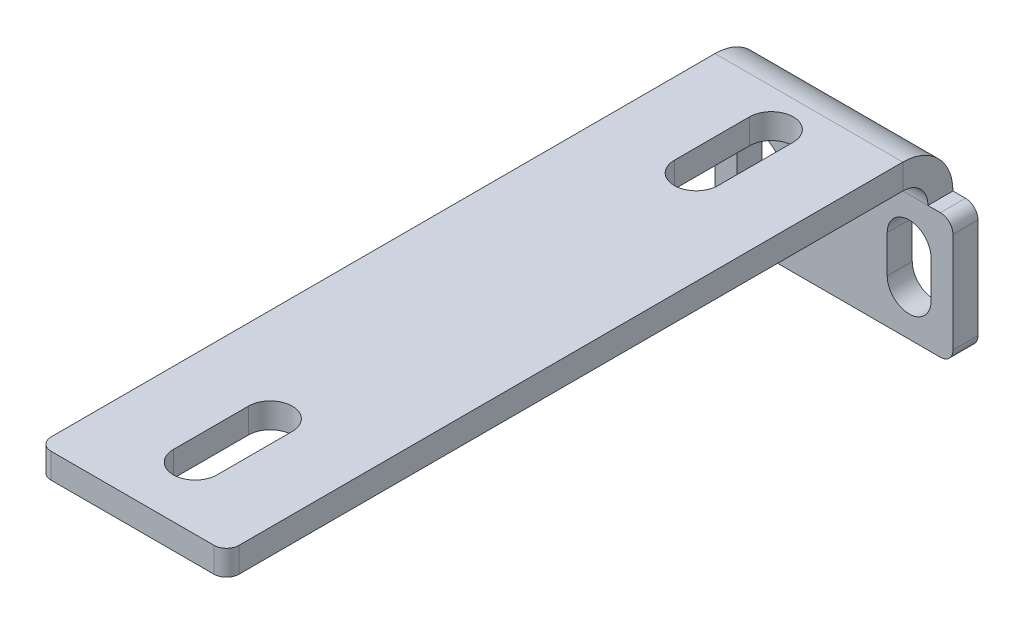
ISO-10303-21;
HEADER;
FILE_DESCRIPTION(('STEP AP214'),'2;1');
FILE_NAME('part.step','',(''),(''),'','','');
FILE_SCHEMA(('AUTOMOTIVE_DESIGN { 1 0 10303 214 1 1 1 1 }'));
ENDSEC;
DATA;
#1=APPLICATION_CONTEXT('core data for automotive mechanical design processes');
#2=APPLICATION_PROTOCOL_DEFINITION('international standard','automotive_design',2000,#1);
#3=PRODUCT_CONTEXT('',#1,'mechanical');
#4=PRODUCT('Part','Part','',(#3));
#5=PRODUCT_RELATED_PRODUCT_CATEGORY('part','',(#4));
#6=PRODUCT_DEFINITION_FORMATION('','',#4);
#7=PRODUCT_DEFINITION_CONTEXT('part definition',#1,'design');
#8=PRODUCT_DEFINITION('design','',#6,#7);
#9=PRODUCT_DEFINITION_SHAPE('','',#8);
#10=(LENGTH_UNIT() NAMED_UNIT(*) SI_UNIT(.MILLI.,.METRE.));
#11=(NAMED_UNIT(*) PLANE_ANGLE_UNIT() SI_UNIT($,.RADIAN.));
#12=(NAMED_UNIT(*) SI_UNIT($,.STERADIAN.) SOLID_ANGLE_UNIT());
#13=UNCERTAINTY_MEASURE_WITH_UNIT(LENGTH_MEASURE(1.E-05),#10,'distance_accuracy_value','');
#14=(GEOMETRIC_REPRESENTATION_CONTEXT(3) GLOBAL_UNCERTAINTY_ASSIGNED_CONTEXT((#13)) GLOBAL_UNIT_ASSIGNED_CONTEXT((#10,
#11,#12)) REPRESENTATION_CONTEXT('',''));
#15=CARTESIAN_POINT('',(0.,0.,0.));
#16=DIRECTION('',(0.,0.,1.));
#17=DIRECTION('',(1.,0.,0.));
#18=AXIS2_PLACEMENT_3D('',#15,#16,#17);
#19=CARTESIAN_POINT('',(0.,0.,-2.));
#20=DIRECTION('',(0.,1.,0.));
#21=DIRECTION('',(-1.,0.,0.));
#22=AXIS2_PLACEMENT_3D('',#19,#20,#21);
#23=PLANE('',#22);
#24=DIRECTION('',(-1.,0.,0.));
#25=VECTOR('',#24,1.);
#26=CARTESIAN_POINT('',(0.,0.,-2.));
#27=LINE('',#26,#25);
#28=CARTESIAN_POINT('',(2.,0.,-2.));
#29=VERTEX_POINT('',#28);
#30=CARTESIAN_POINT('',(1.,0.,-2.));
#31=VERTEX_POINT('',#30);
#32=EDGE_CURVE('E540',#29,#31,#27,.T.);
#33=ORIENTED_EDGE('',*,*,#32,.T.);
#34=DIRECTION('',(0.,0.,1.));
#35=VECTOR('',#34,1.);
#36=CARTESIAN_POINT('',(1.,0.,-2.));
#37=LINE('',#36,#35);
#38=CARTESIAN_POINT('',(1.,0.,0.));
#39=VERTEX_POINT('',#38);
#40=EDGE_CURVE('E544',#31,#39,#37,.T.);
#41=ORIENTED_EDGE('',*,*,#40,.T.);
#42=DIRECTION('',(-1.,0.,0.));
#43=VECTOR('',#42,1.);
#44=CARTESIAN_POINT('',(0.,0.,0.));
#45=LINE('',#44,#43);
#46=CARTESIAN_POINT('',(2.,0.,0.));
#47=VERTEX_POINT('',#46);
#48=EDGE_CURVE('E556',#47,#39,#45,.T.);
#49=ORIENTED_EDGE('',*,*,#48,.F.);
#50=DIRECTION('',(0.,0.,-1.));
#51=VECTOR('',#50,1.);
#52=CARTESIAN_POINT('',(2.,0.,0.));
#53=LINE('',#52,#51);
#54=EDGE_CURVE('E417',#47,#29,#53,.T.);
#55=ORIENTED_EDGE('',*,*,#54,.T.);
#56=EDGE_LOOP('',(#33,#41,#49,#55));
#57=FACE_BOUND('',#56,.T.);
#58=ADVANCED_FACE('F62',(#57),#23,.T.);
#59=CARTESIAN_POINT('',(0.,0.,-2.));
#60=DIRECTION('',(-1.,0.,0.));
#61=DIRECTION('',(0.,0.,1.));
#62=AXIS2_PLACEMENT_3D('',#59,#60,#61);
#63=PLANE('',#62);
#64=DIRECTION('',(0.,-1.,0.));
#65=VECTOR('',#64,1.);
#66=CARTESIAN_POINT('',(0.,0.,0.));
#67=LINE('',#66,#65);
#68=CARTESIAN_POINT('',(0.,-1.,0.));
#69=VERTEX_POINT('',#68);
#70=CARTESIAN_POINT('',(0.,-9.,0.));
#71=VERTEX_POINT('',#70);
#72=EDGE_CURVE('E517',#69,#71,#67,.T.);
#73=ORIENTED_EDGE('',*,*,#72,.F.);
#74=DIRECTION('',(0.,0.,1.));
#75=VECTOR('',#74,1.);
#76=CARTESIAN_POINT('',(0.,-1.,-2.));
#77=LINE('',#76,#75);
#78=CARTESIAN_POINT('',(0.,-1.,-2.));
#79=VERTEX_POINT('',#78);
#80=EDGE_CURVE('E578',#69,#79,#77,.F.);
#81=ORIENTED_EDGE('',*,*,#80,.T.);
#82=DIRECTION('',(0.,-1.,0.));
#83=VECTOR('',#82,1.);
#84=CARTESIAN_POINT('',(0.,0.,-2.));
#85=LINE('',#84,#83);
#86=CARTESIAN_POINT('',(0.,-9.,-2.));
#87=VERTEX_POINT('',#86);
#88=EDGE_CURVE('E527',#79,#87,#85,.T.);
#89=ORIENTED_EDGE('',*,*,#88,.T.);
#90=DIRECTION('',(0.,0.,1.));
#91=VECTOR('',#90,1.);
#92=CARTESIAN_POINT('',(0.,-9.,-2.));
#93=LINE('',#92,#91);
#94=EDGE_CURVE('E574',#87,#71,#93,.T.);
#95=ORIENTED_EDGE('',*,*,#94,.T.);
#96=EDGE_LOOP('',(#73,#81,#89,#95));
#97=FACE_BOUND('',#96,.T.);
#98=ADVANCED_FACE('F642',(#97),#63,.T.);
#99=CARTESIAN_POINT('',(18.,0.,0.));
#100=VERTEX_POINT('',#99);
#101=CARTESIAN_POINT('',(17.,0.,0.));
#102=VERTEX_POINT('',#101);
#103=EDGE_CURVE('E532',#100,#102,#45,.T.);
#104=ORIENTED_EDGE('',*,*,#103,.F.);
#105=DIRECTION('',(0.,0.,1.));
#106=VECTOR('',#105,1.);
#107=CARTESIAN_POINT('',(18.,0.,-2.));
#108=LINE('',#107,#106);
#109=CARTESIAN_POINT('',(18.,0.,-2.));
#110=VERTEX_POINT('',#109);
#111=EDGE_CURVE('E600',#100,#110,#108,.F.);
#112=ORIENTED_EDGE('',*,*,#111,.T.);
#113=CARTESIAN_POINT('',(17.,0.,-2.));
#114=VERTEX_POINT('',#113);
#115=EDGE_CURVE('E541',#110,#114,#27,.T.);
#116=ORIENTED_EDGE('',*,*,#115,.T.);
#117=DIRECTION('',(0.,0.,-1.));
#118=VECTOR('',#117,1.);
#119=CARTESIAN_POINT('',(17.,0.,0.));
#120=LINE('',#119,#118);
#121=EDGE_CURVE('E431',#102,#114,#120,.T.);
#122=ORIENTED_EDGE('',*,*,#121,.F.);
#123=EDGE_LOOP('',(#104,#112,#116,#122));
#124=FACE_BOUND('',#123,.T.);
#125=ADVANCED_FACE('F704',(#124),#23,.T.);
#126=CARTESIAN_POINT('',(19.,0.,-2.));
#127=DIRECTION('',(1.,0.,0.));
#128=DIRECTION('',(0.,0.,-1.));
#129=AXIS2_PLACEMENT_3D('',#126,#127,#128);
#130=PLANE('',#129);
#131=DIRECTION('',(0.,1.,0.));
#132=VECTOR('',#131,1.);
#133=CARTESIAN_POINT('',(19.,0.,-2.));
#134=LINE('',#133,#132);
#135=CARTESIAN_POINT('',(19.,-9.,-2.));
#136=VERTEX_POINT('',#135);
#137=CARTESIAN_POINT('',(19.,-1.,-2.));
#138=VERTEX_POINT('',#137);
#139=EDGE_CURVE('E536',#136,#138,#134,.T.);
#140=ORIENTED_EDGE('',*,*,#139,.T.);
#141=DIRECTION('',(0.,0.,1.));
#142=VECTOR('',#141,1.);
#143=CARTESIAN_POINT('',(19.,-1.,-2.));
#144=LINE('',#143,#142);
#145=CARTESIAN_POINT('',(19.,-1.,0.));
#146=VERTEX_POINT('',#145);
#147=EDGE_CURVE('E596',#138,#146,#144,.T.);
#148=ORIENTED_EDGE('',*,*,#147,.T.);
#149=DIRECTION('',(0.,1.,0.));
#150=VECTOR('',#149,1.);
#151=CARTESIAN_POINT('',(19.,0.,0.));
#152=LINE('',#151,#150);
#153=CARTESIAN_POINT('',(19.,-9.,0.));
#154=VERTEX_POINT('',#153);
#155=EDGE_CURVE('E552',#154,#146,#152,.T.);
#156=ORIENTED_EDGE('',*,*,#155,.F.);
#157=DIRECTION('',(0.,0.,1.));
#158=VECTOR('',#157,1.);
#159=CARTESIAN_POINT('',(19.,-9.,-2.));
#160=LINE('',#159,#158);
#161=EDGE_CURVE('E593',#154,#136,#160,.F.);
#162=ORIENTED_EDGE('',*,*,#161,.T.);
#163=EDGE_LOOP('',(#140,#148,#156,#162));
#164=FACE_BOUND('',#163,.T.);
#165=ADVANCED_FACE('F713',(#164),#130,.T.);
#166=CARTESIAN_POINT('',(0.,-10.,-2.));
#167=DIRECTION('',(0.,-1.,0.));
#168=DIRECTION('',(1.,0.,0.));
#169=AXIS2_PLACEMENT_3D('',#166,#167,#168);
#170=PLANE('',#169);
#171=DIRECTION('',(1.,0.,0.));
#172=VECTOR('',#171,1.);
#173=CARTESIAN_POINT('',(0.,-10.,-2.));
#174=LINE('',#173,#172);
#175=CARTESIAN_POINT('',(1.,-10.,-2.));
#176=VERTEX_POINT('',#175);
#177=CARTESIAN_POINT('',(18.,-10.,-2.));
#178=VERTEX_POINT('',#177);
#179=EDGE_CURVE('E531',#176,#178,#174,.T.);
#180=ORIENTED_EDGE('',*,*,#179,.T.);
#181=DIRECTION('',(0.,0.,1.));
#182=VECTOR('',#181,1.);
#183=CARTESIAN_POINT('',(18.,-10.,-2.));
#184=LINE('',#183,#182);
#185=CARTESIAN_POINT('',(18.,-10.,0.));
#186=VERTEX_POINT('',#185);
#187=EDGE_CURVE('E13',#178,#186,#184,.T.);
#188=ORIENTED_EDGE('',*,*,#187,.T.);
#189=DIRECTION('',(1.,0.,0.));
#190=VECTOR('',#189,1.);
#191=CARTESIAN_POINT('',(0.,-10.,0.));
#192=LINE('',#191,#190);
#193=CARTESIAN_POINT('',(1.,-10.,0.));
#194=VERTEX_POINT('',#193);
#195=EDGE_CURVE('E548',#194,#186,#192,.T.);
#196=ORIENTED_EDGE('',*,*,#195,.F.);
#197=DIRECTION('',(0.,0.,1.));
#198=VECTOR('',#197,1.);
#199=CARTESIAN_POINT('',(1.,-10.,-2.));
#200=LINE('',#199,#198);
#201=EDGE_CURVE('E71',#194,#176,#200,.F.);
#202=ORIENTED_EDGE('',*,*,#201,.T.);
#203=EDGE_LOOP('',(#180,#188,#196,#202));
#204=FACE_BOUND('',#203,.T.);
#205=ADVANCED_FACE('F630',(#204),#170,.T.);
#206=CARTESIAN_POINT('',(0.,0.,-2.));
#207=DIRECTION('',(0.,0.,1.));
#208=DIRECTION('',(1.,0.,0.));
#209=AXIS2_PLACEMENT_3D('',#206,#207,#208);
#210=PLANE('',#209);
#211=DIRECTION('',(0.,1.,0.));
#212=VECTOR('',#211,1.);
#213=CARTESIAN_POINT('',(17.25,-3.5,-2.));
#214=LINE('',#213,#212);
#215=CARTESIAN_POINT('',(17.25,-6.5,-2.));
#216=VERTEX_POINT('',#215);
#217=CARTESIAN_POINT('',(17.25,-3.5,-2.));
#218=VERTEX_POINT('',#217);
#219=EDGE_CURVE('E452',#216,#218,#214,.T.);
#220=ORIENTED_EDGE('',*,*,#219,.T.);
#221=CARTESIAN_POINT('',(15.5,-3.5,-2.));
#222=DIRECTION('',(0.,0.,1.));
#223=DIRECTION('',(1.,0.,0.));
#224=AXIS2_PLACEMENT_3D('',#221,#222,#223);
#225=CIRCLE('',#224,1.75);
#226=CARTESIAN_POINT('',(13.75,-3.5,-2.));
#227=VERTEX_POINT('',#226);
#228=EDGE_CURVE('E439',#218,#227,#225,.T.);
#229=ORIENTED_EDGE('',*,*,#228,.T.);
#230=DIRECTION('',(0.,-1.,0.));
#231=VECTOR('',#230,1.);
#232=CARTESIAN_POINT('',(13.75,-3.5,-2.));
#233=LINE('',#232,#231);
#234=CARTESIAN_POINT('',(13.75,-6.5,-2.));
#235=VERTEX_POINT('',#234);
#236=EDGE_CURVE('E443',#227,#235,#233,.T.);
#237=ORIENTED_EDGE('',*,*,#236,.T.);
#238=CARTESIAN_POINT('',(15.5,-6.5,-2.));
#239=DIRECTION('',(0.,0.,1.));
#240=DIRECTION('',(1.,0.,0.));
#241=AXIS2_PLACEMENT_3D('',#238,#239,#240);
#242=CIRCLE('',#241,1.75);
#243=EDGE_CURVE('E448',#235,#216,#242,.T.);
#244=ORIENTED_EDGE('',*,*,#243,.T.);
#245=EDGE_LOOP('',(#220,#229,#237,#244));
#246=FACE_BOUND('',#245,.T.);
#247=DIRECTION('',(0.,1.,0.));
#248=VECTOR('',#247,1.);
#249=CARTESIAN_POINT('',(5.25,-3.5,-2.));
#250=LINE('',#249,#248);
#251=CARTESIAN_POINT('',(5.25,-6.5,-2.));
#252=VERTEX_POINT('',#251);
#253=CARTESIAN_POINT('',(5.25,-3.5,-2.));
#254=VERTEX_POINT('',#253);
#255=EDGE_CURVE('E496',#252,#254,#250,.T.);
#256=ORIENTED_EDGE('',*,*,#255,.T.);
#257=CARTESIAN_POINT('',(3.5,-3.5,-2.));
#258=DIRECTION('',(0.,0.,1.));
#259=DIRECTION('',(1.,0.,0.));
#260=AXIS2_PLACEMENT_3D('',#257,#258,#259);
#261=CIRCLE('',#260,1.75);
#262=CARTESIAN_POINT('',(1.75,-3.5,-2.));
#263=VERTEX_POINT('',#262);
#264=EDGE_CURVE('E483',#254,#263,#261,.T.);
#265=ORIENTED_EDGE('',*,*,#264,.T.);
#266=DIRECTION('',(0.,-1.,0.));
#267=VECTOR('',#266,1.);
#268=CARTESIAN_POINT('',(1.75,-3.5,-2.));
#269=LINE('',#268,#267);
#270=CARTESIAN_POINT('',(1.75,-6.5,-2.));
#271=VERTEX_POINT('',#270);
#272=EDGE_CURVE('E487',#263,#271,#269,.T.);
#273=ORIENTED_EDGE('',*,*,#272,.T.);
#274=CARTESIAN_POINT('',(3.5,-6.5,-2.));
#275=DIRECTION('',(0.,0.,1.));
#276=DIRECTION('',(1.,0.,0.));
#277=AXIS2_PLACEMENT_3D('',#274,#275,#276);
#278=CIRCLE('',#277,1.75);
#279=EDGE_CURVE('E492',#271,#252,#278,.T.);
#280=ORIENTED_EDGE('',*,*,#279,.T.);
#281=EDGE_LOOP('',(#256,#265,#273,#280));
#282=FACE_BOUND('',#281,.T.);
#283=ORIENTED_EDGE('',*,*,#88,.F.);
#284=CARTESIAN_POINT('',(1.,-1.,-2.));
#285=DIRECTION('',(0.,0.,1.));
#286=DIRECTION('',(1.,0.,0.));
#287=AXIS2_PLACEMENT_3D('',#284,#285,#286);
#288=CIRCLE('',#287,1.);
#289=EDGE_CURVE('E590',#79,#31,#288,.F.);
#290=ORIENTED_EDGE('',*,*,#289,.T.);
#291=ORIENTED_EDGE('',*,*,#32,.F.);
#292=DIRECTION('',(-1.,0.,0.));
#293=VECTOR('',#292,1.);
#294=CARTESIAN_POINT('',(2.,0.,-2.));
#295=LINE('',#294,#293);
#296=EDGE_CURVE('E408',#29,#114,#295,.F.);
#297=ORIENTED_EDGE('',*,*,#296,.T.);
#298=ORIENTED_EDGE('',*,*,#115,.F.);
#299=CARTESIAN_POINT('',(18.,-1.,-2.));
#300=DIRECTION('',(0.,0.,1.));
#301=DIRECTION('',(1.,0.,0.));
#302=AXIS2_PLACEMENT_3D('',#299,#300,#301);
#303=CIRCLE('',#302,1.);
#304=EDGE_CURVE('E587',#110,#138,#303,.F.);
#305=ORIENTED_EDGE('',*,*,#304,.T.);
#306=ORIENTED_EDGE('',*,*,#139,.F.);
#307=CARTESIAN_POINT('',(18.,-9.,-2.));
#308=DIRECTION('',(0.,0.,1.));
#309=DIRECTION('',(1.,0.,0.));
#310=AXIS2_PLACEMENT_3D('',#307,#308,#309);
#311=CIRCLE('',#310,1.);
#312=EDGE_CURVE('E584',#136,#178,#311,.F.);
#313=ORIENTED_EDGE('',*,*,#312,.T.);
#314=ORIENTED_EDGE('',*,*,#179,.F.);
#315=CARTESIAN_POINT('',(1.,-9.,-2.));
#316=DIRECTION('',(0.,0.,1.));
#317=DIRECTION('',(1.,0.,0.));
#318=AXIS2_PLACEMENT_3D('',#315,#316,#317);
#319=CIRCLE('',#318,1.);
#320=EDGE_CURVE('E581',#176,#87,#319,.F.);
#321=ORIENTED_EDGE('',*,*,#320,.T.);
#322=EDGE_LOOP('',(#283,#290,#291,#297,#298,#305,#306,#313,#314,#321));
#323=FACE_BOUND('',#322,.T.);
#324=ADVANCED_FACE('F636',(#246,#282,#323),#210,.F.);
#325=CARTESIAN_POINT('',(0.,0.,0.));
#326=DIRECTION('',(0.,0.,1.));
#327=DIRECTION('',(1.,0.,0.));
#328=AXIS2_PLACEMENT_3D('',#325,#326,#327);
#329=PLANE('',#328);
#330=CARTESIAN_POINT('',(15.5,-3.5,0.));
#331=DIRECTION('',(0.,0.,1.));
#332=DIRECTION('',(1.,0.,0.));
#333=AXIS2_PLACEMENT_3D('',#330,#331,#332);
#334=CIRCLE('',#333,1.75);
#335=CARTESIAN_POINT('',(17.25,-3.5,0.));
#336=VERTEX_POINT('',#335);
#337=CARTESIAN_POINT('',(13.75,-3.5,0.));
#338=VERTEX_POINT('',#337);
#339=EDGE_CURVE('E435',#336,#338,#334,.T.);
#340=ORIENTED_EDGE('',*,*,#339,.F.);
#341=DIRECTION('',(0.,1.,0.));
#342=VECTOR('',#341,1.);
#343=CARTESIAN_POINT('',(17.25,-3.5,0.));
#344=LINE('',#343,#342);
#345=CARTESIAN_POINT('',(17.25,-6.5,0.));
#346=VERTEX_POINT('',#345);
#347=EDGE_CURVE('E444',#346,#336,#344,.T.);
#348=ORIENTED_EDGE('',*,*,#347,.F.);
#349=CARTESIAN_POINT('',(15.5,-6.5,0.));
#350=DIRECTION('',(0.,0.,1.));
#351=DIRECTION('',(1.,0.,0.));
#352=AXIS2_PLACEMENT_3D('',#349,#350,#351);
#353=CIRCLE('',#352,1.75);
#354=CARTESIAN_POINT('',(13.75,-6.5,0.));
#355=VERTEX_POINT('',#354);
#356=EDGE_CURVE('E463',#355,#346,#353,.T.);
#357=ORIENTED_EDGE('',*,*,#356,.F.);
#358=DIRECTION('',(0.,-1.,0.));
#359=VECTOR('',#358,1.);
#360=CARTESIAN_POINT('',(13.75,-3.5,0.));
#361=LINE('',#360,#359);
#362=EDGE_CURVE('E459',#338,#355,#361,.T.);
#363=ORIENTED_EDGE('',*,*,#362,.F.);
#364=EDGE_LOOP('',(#340,#348,#357,#363));
#365=FACE_BOUND('',#364,.T.);
#366=CARTESIAN_POINT('',(3.5,-3.5,0.));
#367=DIRECTION('',(0.,0.,1.));
#368=DIRECTION('',(1.,0.,0.));
#369=AXIS2_PLACEMENT_3D('',#366,#367,#368);
#370=CIRCLE('',#369,1.75);
#371=CARTESIAN_POINT('',(5.25,-3.5,0.));
#372=VERTEX_POINT('',#371);
#373=CARTESIAN_POINT('',(1.75,-3.5,0.));
#374=VERTEX_POINT('',#373);
#375=EDGE_CURVE('E473',#372,#374,#370,.T.);
#376=ORIENTED_EDGE('',*,*,#375,.F.);
#377=DIRECTION('',(0.,1.,0.));
#378=VECTOR('',#377,1.);
#379=CARTESIAN_POINT('',(5.25,-3.5,0.));
#380=LINE('',#379,#378);
#381=CARTESIAN_POINT('',(5.25,-6.5,0.));
#382=VERTEX_POINT('',#381);
#383=EDGE_CURVE('E488',#382,#372,#380,.T.);
#384=ORIENTED_EDGE('',*,*,#383,.F.);
#385=CARTESIAN_POINT('',(3.5,-6.5,0.));
#386=DIRECTION('',(0.,0.,1.));
#387=DIRECTION('',(1.,0.,0.));
#388=AXIS2_PLACEMENT_3D('',#385,#386,#387);
#389=CIRCLE('',#388,1.75);
#390=CARTESIAN_POINT('',(1.75,-6.5,0.));
#391=VERTEX_POINT('',#390);
#392=EDGE_CURVE('E507',#391,#382,#389,.T.);
#393=ORIENTED_EDGE('',*,*,#392,.F.);
#394=DIRECTION('',(0.,-1.,0.));
#395=VECTOR('',#394,1.);
#396=CARTESIAN_POINT('',(1.75,-3.5,0.));
#397=LINE('',#396,#395);
#398=EDGE_CURVE('E503',#374,#391,#397,.T.);
#399=ORIENTED_EDGE('',*,*,#398,.F.);
#400=EDGE_LOOP('',(#376,#384,#393,#399));
#401=FACE_BOUND('',#400,.T.);
#402=ORIENTED_EDGE('',*,*,#48,.T.);
#403=CARTESIAN_POINT('',(1.,-1.,0.));
#404=DIRECTION('',(0.,0.,1.));
#405=DIRECTION('',(1.,0.,0.));
#406=AXIS2_PLACEMENT_3D('',#403,#404,#405);
#407=CIRCLE('',#406,1.);
#408=EDGE_CURVE('E571',#39,#69,#407,.T.);
#409=ORIENTED_EDGE('',*,*,#408,.T.);
#410=ORIENTED_EDGE('',*,*,#72,.T.);
#411=CARTESIAN_POINT('',(1.,-9.,0.));
#412=DIRECTION('',(0.,0.,1.));
#413=DIRECTION('',(1.,0.,0.));
#414=AXIS2_PLACEMENT_3D('',#411,#412,#413);
#415=CIRCLE('',#414,1.);
#416=EDGE_CURVE('E562',#71,#194,#415,.T.);
#417=ORIENTED_EDGE('',*,*,#416,.T.);
#418=ORIENTED_EDGE('',*,*,#195,.T.);
#419=CARTESIAN_POINT('',(18.,-9.,0.));
#420=DIRECTION('',(0.,0.,1.));
#421=DIRECTION('',(1.,0.,0.));
#422=AXIS2_PLACEMENT_3D('',#419,#420,#421);
#423=CIRCLE('',#422,1.);
#424=EDGE_CURVE('E565',#186,#154,#423,.T.);
#425=ORIENTED_EDGE('',*,*,#424,.T.);
#426=ORIENTED_EDGE('',*,*,#155,.T.);
#427=CARTESIAN_POINT('',(18.,-1.,0.));
#428=DIRECTION('',(0.,0.,1.));
#429=DIRECTION('',(1.,0.,0.));
#430=AXIS2_PLACEMENT_3D('',#427,#428,#429);
#431=CIRCLE('',#430,1.);
#432=EDGE_CURVE('E568',#146,#100,#431,.T.);
#433=ORIENTED_EDGE('',*,*,#432,.T.);
#434=ORIENTED_EDGE('',*,*,#103,.T.);
#435=DIRECTION('',(-1.,0.,0.));
#436=VECTOR('',#435,1.);
#437=CARTESIAN_POINT('',(2.,0.,0.));
#438=LINE('',#437,#436);
#439=EDGE_CURVE('E424',#47,#102,#438,.F.);
#440=ORIENTED_EDGE('',*,*,#439,.F.);
#441=EDGE_LOOP('',(#402,#409,#410,#417,#418,#425,#426,#433,#434,#440));
#442=FACE_BOUND('',#441,.T.);
#443=ADVANCED_FACE('F646',(#365,#401,#442),#329,.T.);
#444=CARTESIAN_POINT('',(3.5,-3.5,-2.));
#445=DIRECTION('',(0.,0.,1.));
#446=DIRECTION('',(1.,0.,0.));
#447=AXIS2_PLACEMENT_3D('',#444,#445,#446);
#448=CYLINDRICAL_SURFACE('',#447,1.75);
#449=ORIENTED_EDGE('',*,*,#375,.T.);
#450=DIRECTION('',(0.,0.,1.));
#451=VECTOR('',#450,1.);
#452=CARTESIAN_POINT('',(1.75,-3.5,-2.));
#453=LINE('',#452,#451);
#454=EDGE_CURVE('E500',#263,#374,#453,.T.);
#455=ORIENTED_EDGE('',*,*,#454,.F.);
#456=ORIENTED_EDGE('',*,*,#264,.F.);
#457=DIRECTION('',(0.,0.,1.));
#458=VECTOR('',#457,1.);
#459=CARTESIAN_POINT('',(5.25,-3.5,-2.));
#460=LINE('',#459,#458);
#461=EDGE_CURVE('E514',#254,#372,#460,.T.);
#462=ORIENTED_EDGE('',*,*,#461,.T.);
#463=EDGE_LOOP('',(#449,#455,#456,#462));
#464=FACE_BOUND('',#463,.T.);
#465=ADVANCED_FACE('F1052',(#464),#448,.F.);
#466=CARTESIAN_POINT('',(5.25,-3.5,-2.));
#467=DIRECTION('',(1.,0.,0.));
#468=DIRECTION('',(0.,1.,0.));
#469=AXIS2_PLACEMENT_3D('',#466,#467,#468);
#470=PLANE('',#469);
#471=ORIENTED_EDGE('',*,*,#383,.T.);
#472=ORIENTED_EDGE('',*,*,#461,.F.);
#473=ORIENTED_EDGE('',*,*,#255,.F.);
#474=DIRECTION('',(0.,0.,1.));
#475=VECTOR('',#474,1.);
#476=CARTESIAN_POINT('',(5.25,-6.5,-2.));
#477=LINE('',#476,#475);
#478=EDGE_CURVE('E518',#252,#382,#477,.T.);
#479=ORIENTED_EDGE('',*,*,#478,.T.);
#480=EDGE_LOOP('',(#471,#472,#473,#479));
#481=FACE_BOUND('',#480,.T.);
#482=ADVANCED_FACE('F1040',(#481),#470,.F.);
#483=CARTESIAN_POINT('',(3.5,-6.5,-2.));
#484=DIRECTION('',(0.,0.,1.));
#485=DIRECTION('',(1.,0.,0.));
#486=AXIS2_PLACEMENT_3D('',#483,#484,#485);
#487=CYLINDRICAL_SURFACE('',#486,1.75);
#488=ORIENTED_EDGE('',*,*,#392,.T.);
#489=ORIENTED_EDGE('',*,*,#478,.F.);
#490=ORIENTED_EDGE('',*,*,#279,.F.);
#491=DIRECTION('',(0.,0.,1.));
#492=VECTOR('',#491,1.);
#493=CARTESIAN_POINT('',(1.75,-6.5,-2.));
#494=LINE('',#493,#492);
#495=EDGE_CURVE('E521',#271,#391,#494,.T.);
#496=ORIENTED_EDGE('',*,*,#495,.T.);
#497=EDGE_LOOP('',(#488,#489,#490,#496));
#498=FACE_BOUND('',#497,.T.);
#499=ADVANCED_FACE('F1028',(#498),#487,.F.);
#500=CARTESIAN_POINT('',(1.75,-3.5,-2.));
#501=DIRECTION('',(-1.,0.,0.));
#502=DIRECTION('',(0.,-1.,0.));
#503=AXIS2_PLACEMENT_3D('',#500,#501,#502);
#504=PLANE('',#503);
#505=ORIENTED_EDGE('',*,*,#398,.T.);
#506=ORIENTED_EDGE('',*,*,#495,.F.);
#507=ORIENTED_EDGE('',*,*,#272,.F.);
#508=ORIENTED_EDGE('',*,*,#454,.T.);
#509=EDGE_LOOP('',(#505,#506,#507,#508));
#510=FACE_BOUND('',#509,.T.);
#511=ADVANCED_FACE('F1016',(#510),#504,.F.);
#512=CARTESIAN_POINT('',(15.5,-3.5,-2.));
#513=DIRECTION('',(0.,0.,1.));
#514=DIRECTION('',(1.,0.,0.));
#515=AXIS2_PLACEMENT_3D('',#512,#513,#514);
#516=CYLINDRICAL_SURFACE('',#515,1.75);
#517=ORIENTED_EDGE('',*,*,#339,.T.);
#518=DIRECTION('',(0.,0.,1.));
#519=VECTOR('',#518,1.);
#520=CARTESIAN_POINT('',(13.75,-3.5,-2.));
#521=LINE('',#520,#519);
#522=EDGE_CURVE('E456',#227,#338,#521,.T.);
#523=ORIENTED_EDGE('',*,*,#522,.F.);
#524=ORIENTED_EDGE('',*,*,#228,.F.);
#525=DIRECTION('',(0.,0.,1.));
#526=VECTOR('',#525,1.);
#527=CARTESIAN_POINT('',(17.25,-3.5,-2.));
#528=LINE('',#527,#526);
#529=EDGE_CURVE('E470',#218,#336,#528,.T.);
#530=ORIENTED_EDGE('',*,*,#529,.T.);
#531=EDGE_LOOP('',(#517,#523,#524,#530));
#532=FACE_BOUND('',#531,.T.);
#533=ADVANCED_FACE('F1004',(#532),#516,.F.);
#534=CARTESIAN_POINT('',(17.25,-3.5,-2.));
#535=DIRECTION('',(1.,0.,0.));
#536=DIRECTION('',(0.,0.,-1.));
#537=AXIS2_PLACEMENT_3D('',#534,#535,#536);
#538=PLANE('',#537);
#539=ORIENTED_EDGE('',*,*,#347,.T.);
#540=ORIENTED_EDGE('',*,*,#529,.F.);
#541=ORIENTED_EDGE('',*,*,#219,.F.);
#542=DIRECTION('',(0.,0.,1.));
#543=VECTOR('',#542,1.);
#544=CARTESIAN_POINT('',(17.25,-6.5,-2.));
#545=LINE('',#544,#543);
#546=EDGE_CURVE('E474',#216,#346,#545,.T.);
#547=ORIENTED_EDGE('',*,*,#546,.T.);
#548=EDGE_LOOP('',(#539,#540,#541,#547));
#549=FACE_BOUND('',#548,.T.);
#550=ADVANCED_FACE('F992',(#549),#538,.F.);
#551=CARTESIAN_POINT('',(15.5,-6.5,-2.));
#552=DIRECTION('',(0.,0.,1.));
#553=DIRECTION('',(1.,0.,0.));
#554=AXIS2_PLACEMENT_3D('',#551,#552,#553);
#555=CYLINDRICAL_SURFACE('',#554,1.75);
#556=ORIENTED_EDGE('',*,*,#356,.T.);
#557=ORIENTED_EDGE('',*,*,#546,.F.);
#558=ORIENTED_EDGE('',*,*,#243,.F.);
#559=DIRECTION('',(0.,0.,1.));
#560=VECTOR('',#559,1.);
#561=CARTESIAN_POINT('',(13.75,-6.5,-2.));
#562=LINE('',#561,#560);
#563=EDGE_CURVE('E477',#235,#355,#562,.T.);
#564=ORIENTED_EDGE('',*,*,#563,.T.);
#565=EDGE_LOOP('',(#556,#557,#558,#564));
#566=FACE_BOUND('',#565,.T.);
#567=ADVANCED_FACE('F980',(#566),#555,.F.);
#568=CARTESIAN_POINT('',(13.75,-3.5,-2.));
#569=DIRECTION('',(-1.,0.,0.));
#570=DIRECTION('',(0.,-1.,0.));
#571=AXIS2_PLACEMENT_3D('',#568,#569,#570);
#572=PLANE('',#571);
#573=ORIENTED_EDGE('',*,*,#362,.T.);
#574=ORIENTED_EDGE('',*,*,#563,.F.);
#575=ORIENTED_EDGE('',*,*,#236,.F.);
#576=ORIENTED_EDGE('',*,*,#522,.T.);
#577=EDGE_LOOP('',(#573,#574,#575,#576));
#578=FACE_BOUND('',#577,.T.);
#579=ADVANCED_FACE('F964',(#578),#572,.F.);
#580=CARTESIAN_POINT('',(17.,0.,2.));
#581=DIRECTION('',(1.,0.,0.));
#582=DIRECTION('',(0.,1.,0.));
#583=AXIS2_PLACEMENT_3D('',#580,#581,#582);
#584=PLANE('',#583);
#585=DIRECTION('',(0.,-1.,0.));
#586=VECTOR('',#585,1.);
#587=CARTESIAN_POINT('',(17.,4.,1.99999999999999));
#588=LINE('',#587,#586);
#589=CARTESIAN_POINT('',(17.,2.,1.99999999999999));
#590=VERTEX_POINT('',#589);
#591=CARTESIAN_POINT('',(17.,4.,1.99999999999999));
#592=VERTEX_POINT('',#591);
#593=EDGE_CURVE('E373',#590,#592,#588,.F.);
#594=ORIENTED_EDGE('',*,*,#593,.F.);
#595=CARTESIAN_POINT('',(17.,0.,2.));
#596=DIRECTION('',(-1.,0.,0.));
#597=DIRECTION('',(0.,-1.,0.));
#598=AXIS2_PLACEMENT_3D('',#595,#596,#597);
#599=CIRCLE('',#598,2.);
#600=EDGE_CURVE('E420',#102,#590,#599,.F.);
#601=ORIENTED_EDGE('',*,*,#600,.F.);
#602=ORIENTED_EDGE('',*,*,#121,.T.);
#603=CARTESIAN_POINT('',(17.,0.,2.));
#604=DIRECTION('',(-1.,0.,0.));
#605=DIRECTION('',(0.,-1.,0.));
#606=AXIS2_PLACEMENT_3D('',#603,#604,#605);
#607=CIRCLE('',#606,4.);
#608=EDGE_CURVE('E412',#114,#592,#607,.F.);
#609=ORIENTED_EDGE('',*,*,#608,.T.);
#610=EDGE_LOOP('',(#594,#601,#602,#609));
#611=FACE_BOUND('',#610,.T.);
#612=ADVANCED_FACE('F699',(#611),#584,.T.);
#613=CARTESIAN_POINT('',(2.,0.,2.));
#614=DIRECTION('',(1.,0.,0.));
#615=DIRECTION('',(0.,1.,0.));
#616=AXIS2_PLACEMENT_3D('',#613,#614,#615);
#617=PLANE('',#616);
#618=CARTESIAN_POINT('',(2.,0.,2.));
#619=DIRECTION('',(-1.,0.,0.));
#620=DIRECTION('',(0.,-1.,0.));
#621=AXIS2_PLACEMENT_3D('',#618,#619,#620);
#622=CIRCLE('',#621,2.);
#623=CARTESIAN_POINT('',(2.,2.,1.99999999999999));
#624=VERTEX_POINT('',#623);
#625=EDGE_CURVE('E377',#624,#47,#622,.T.);
#626=ORIENTED_EDGE('',*,*,#625,.F.);
#627=DIRECTION('',(0.,-1.,0.));
#628=VECTOR('',#627,1.);
#629=CARTESIAN_POINT('',(2.,2.,1.99999999999999));
#630=LINE('',#629,#628);
#631=CARTESIAN_POINT('',(2.,4.,1.99999999999999));
#632=VERTEX_POINT('',#631);
#633=EDGE_CURVE('E398',#624,#632,#630,.F.);
#634=ORIENTED_EDGE('',*,*,#633,.T.);
#635=CARTESIAN_POINT('',(2.,0.,2.));
#636=DIRECTION('',(-1.,0.,0.));
#637=DIRECTION('',(0.,-1.,0.));
#638=AXIS2_PLACEMENT_3D('',#635,#636,#637);
#639=CIRCLE('',#638,4.);
#640=EDGE_CURVE('E413',#632,#29,#639,.T.);
#641=ORIENTED_EDGE('',*,*,#640,.T.);
#642=ORIENTED_EDGE('',*,*,#54,.F.);
#643=EDGE_LOOP('',(#626,#634,#641,#642));
#644=FACE_BOUND('',#643,.T.);
#645=ADVANCED_FACE('F942',(#644),#617,.F.);
#646=CARTESIAN_POINT('',(2.,0.,2.));
#647=DIRECTION('',(-1.,0.,0.));
#648=DIRECTION('',(0.,1.,0.));
#649=AXIS2_PLACEMENT_3D('',#646,#647,#648);
#650=CYLINDRICAL_SURFACE('',#649,4.);
#651=ORIENTED_EDGE('',*,*,#296,.F.);
#652=ORIENTED_EDGE('',*,*,#640,.F.);
#653=DIRECTION('',(-1.,0.,0.));
#654=VECTOR('',#653,1.);
#655=CARTESIAN_POINT('',(17.,4.,1.99999999999999));
#656=LINE('',#655,#654);
#657=EDGE_CURVE('E394',#632,#592,#656,.F.);
#658=ORIENTED_EDGE('',*,*,#657,.T.);
#659=ORIENTED_EDGE('',*,*,#608,.F.);
#660=EDGE_LOOP('',(#651,#652,#658,#659));
#661=FACE_BOUND('',#660,.T.);
#662=ADVANCED_FACE('F697',(#661),#650,.T.);
#663=CARTESIAN_POINT('',(2.,0.,2.));
#664=DIRECTION('',(-1.,0.,0.));
#665=DIRECTION('',(0.,1.,0.));
#666=AXIS2_PLACEMENT_3D('',#663,#664,#665);
#667=CYLINDRICAL_SURFACE('',#666,2.);
#668=ORIENTED_EDGE('',*,*,#439,.T.);
#669=ORIENTED_EDGE('',*,*,#600,.T.);
#670=DIRECTION('',(-1.,0.,0.));
#671=VECTOR('',#670,1.);
#672=CARTESIAN_POINT('',(17.,2.,1.99999999999999));
#673=LINE('',#672,#671);
#674=EDGE_CURVE('E402',#590,#624,#673,.T.);
#675=ORIENTED_EDGE('',*,*,#674,.T.);
#676=ORIENTED_EDGE('',*,*,#625,.T.);
#677=EDGE_LOOP('',(#668,#669,#675,#676));
#678=FACE_BOUND('',#677,.T.);
#679=ADVANCED_FACE('F920',(#678),#667,.F.);
#680=CARTESIAN_POINT('',(2.,3.99999999999999,0.));
#681=DIRECTION('',(1.,0.,0.));
#682=DIRECTION('',(0.,1.,0.));
#683=AXIS2_PLACEMENT_3D('',#680,#681,#682);
#684=PLANE('',#683);
#685=DIRECTION('',(0.,0.,-1.));
#686=VECTOR('',#685,1.);
#687=CARTESIAN_POINT('',(2.,1.99999999999999,0.));
#688=LINE('',#687,#686);
#689=CARTESIAN_POINT('',(2.,2.00000000000019,55.));
#690=VERTEX_POINT('',#689);
#691=EDGE_CURVE('E391',#624,#690,#688,.F.);
#692=ORIENTED_EDGE('',*,*,#691,.T.);
#693=DIRECTION('',(0.,-1.,0.));
#694=VECTOR('',#693,1.);
#695=CARTESIAN_POINT('',(2.,4.00000000000018,55.));
#696=LINE('',#695,#694);
#697=CARTESIAN_POINT('',(2.,4.00000000000018,55.));
#698=VERTEX_POINT('',#697);
#699=EDGE_CURVE('E86',#690,#698,#696,.F.);
#700=ORIENTED_EDGE('',*,*,#699,.T.);
#701=DIRECTION('',(0.,0.,1.));
#702=VECTOR('',#701,1.);
#703=CARTESIAN_POINT('',(2.,3.99999999999999,0.));
#704=LINE('',#703,#702);
#705=EDGE_CURVE('E381',#632,#698,#704,.T.);
#706=ORIENTED_EDGE('',*,*,#705,.F.);
#707=ORIENTED_EDGE('',*,*,#633,.F.);
#708=EDGE_LOOP('',(#692,#700,#706,#707));
#709=FACE_BOUND('',#708,.T.);
#710=ADVANCED_FACE('F909',(#709),#684,.F.);
#711=CARTESIAN_POINT('',(17.,3.99999999999999,0.));
#712=DIRECTION('',(-1.,0.,0.));
#713=DIRECTION('',(0.,-1.,0.));
#714=AXIS2_PLACEMENT_3D('',#711,#712,#713);
#715=PLANE('',#714);
#716=DIRECTION('',(0.,0.,-1.));
#717=VECTOR('',#716,1.);
#718=CARTESIAN_POINT('',(17.,3.99999999999999,0.));
#719=LINE('',#718,#717);
#720=CARTESIAN_POINT('',(17.,4.00000000000018,55.));
#721=VERTEX_POINT('',#720);
#722=EDGE_CURVE('E374',#721,#592,#719,.T.);
#723=ORIENTED_EDGE('',*,*,#722,.F.);
#724=DIRECTION('',(0.,-1.,0.));
#725=VECTOR('',#724,1.);
#726=CARTESIAN_POINT('',(17.,4.00000000000018,55.));
#727=LINE('',#726,#725);
#728=CARTESIAN_POINT('',(17.,2.00000000000018,55.));
#729=VERTEX_POINT('',#728);
#730=EDGE_CURVE('E622',#721,#729,#727,.T.);
#731=ORIENTED_EDGE('',*,*,#730,.T.);
#732=DIRECTION('',(0.,0.,1.));
#733=VECTOR('',#732,1.);
#734=CARTESIAN_POINT('',(17.,1.99999999999999,0.));
#735=LINE('',#734,#733);
#736=EDGE_CURVE('E384',#729,#590,#735,.F.);
#737=ORIENTED_EDGE('',*,*,#736,.T.);
#738=ORIENTED_EDGE('',*,*,#593,.T.);
#739=EDGE_LOOP('',(#723,#731,#737,#738));
#740=FACE_BOUND('',#739,.T.);
#741=ADVANCED_FACE('F669',(#740),#715,.F.);
#742=CARTESIAN_POINT('',(0.,3.99999999999999,0.));
#743=DIRECTION('',(0.,-1.,0.));
#744=DIRECTION('',(0.,0.,-1.));
#745=AXIS2_PLACEMENT_3D('',#742,#743,#744);
#746=PLANE('',#745);
#747=DIRECTION('',(0.,0.,-1.));
#748=VECTOR('',#747,1.);
#749=CARTESIAN_POINT('',(11.25,4.00000000000017,51.));
#750=LINE('',#749,#748);
#751=CARTESIAN_POINT('',(11.25,4.00000000000017,51.));
#752=VERTEX_POINT('',#751);
#753=CARTESIAN_POINT('',(11.25,4.00000000000015,45.));
#754=VERTEX_POINT('',#753);
#755=EDGE_CURVE('E308',#752,#754,#750,.T.);
#756=ORIENTED_EDGE('',*,*,#755,.F.);
#757=CARTESIAN_POINT('',(9.50000000000001,4.00000000000017,51.));
#758=DIRECTION('',(0.,1.,0.));
#759=DIRECTION('',(0.,0.,1.));
#760=AXIS2_PLACEMENT_3D('',#757,#758,#759);
#761=CIRCLE('',#760,1.74999999999999);
#762=CARTESIAN_POINT('',(7.75000000000001,4.00000000000017,51.));
#763=VERTEX_POINT('',#762);
#764=EDGE_CURVE('E295',#763,#752,#761,.T.);
#765=ORIENTED_EDGE('',*,*,#764,.F.);
#766=DIRECTION('',(0.,0.,1.));
#767=VECTOR('',#766,1.);
#768=CARTESIAN_POINT('',(7.75000000000001,4.00000000000017,51.));
#769=LINE('',#768,#767);
#770=CARTESIAN_POINT('',(7.75000000000001,4.00000000000015,45.));
#771=VERTEX_POINT('',#770);
#772=EDGE_CURVE('E297',#771,#763,#769,.T.);
#773=ORIENTED_EDGE('',*,*,#772,.F.);
#774=CARTESIAN_POINT('',(9.5,4.00000000000015,45.));
#775=DIRECTION('',(0.,1.,0.));
#776=DIRECTION('',(0.,0.,1.));
#777=AXIS2_PLACEMENT_3D('',#774,#775,#776);
#778=CIRCLE('',#777,1.74999999999999);
#779=EDGE_CURVE('E317',#754,#771,#778,.T.);
#780=ORIENTED_EDGE('',*,*,#779,.F.);
#781=EDGE_LOOP('',(#756,#765,#773,#780));
#782=FACE_BOUND('',#781,.T.);
#783=DIRECTION('',(0.,0.,-1.));
#784=VECTOR('',#783,1.);
#785=CARTESIAN_POINT('',(11.25,4.00000000000003,11.));
#786=LINE('',#785,#784);
#787=CARTESIAN_POINT('',(11.25,4.00000000000003,11.));
#788=VERTEX_POINT('',#787);
#789=CARTESIAN_POINT('',(11.25,4.00000000000001,4.99999999999999));
#790=VERTEX_POINT('',#789);
#791=EDGE_CURVE('E345',#788,#790,#786,.T.);
#792=ORIENTED_EDGE('',*,*,#791,.F.);
#793=CARTESIAN_POINT('',(9.5,4.00000000000003,11.));
#794=DIRECTION('',(0.,1.,0.));
#795=DIRECTION('',(0.,0.,1.));
#796=AXIS2_PLACEMENT_3D('',#793,#794,#795);
#797=CIRCLE('',#796,1.75);
#798=CARTESIAN_POINT('',(7.75000000000001,4.00000000000003,11.));
#799=VERTEX_POINT('',#798);
#800=EDGE_CURVE('E342',#799,#788,#797,.T.);
#801=ORIENTED_EDGE('',*,*,#800,.F.);
#802=DIRECTION('',(0.,0.,1.));
#803=VECTOR('',#802,1.);
#804=CARTESIAN_POINT('',(7.75000000000001,4.00000000000003,11.));
#805=LINE('',#804,#803);
#806=CARTESIAN_POINT('',(7.75,4.00000000000001,4.99999999999999));
#807=VERTEX_POINT('',#806);
#808=EDGE_CURVE('E353',#807,#799,#805,.T.);
#809=ORIENTED_EDGE('',*,*,#808,.F.);
#810=CARTESIAN_POINT('',(9.5,4.00000000000001,4.99999999999999));
#811=DIRECTION('',(0.,1.,0.));
#812=DIRECTION('',(0.,0.,1.));
#813=AXIS2_PLACEMENT_3D('',#810,#811,#812);
#814=CIRCLE('',#813,1.75);
#815=EDGE_CURVE('E349',#790,#807,#814,.T.);
#816=ORIENTED_EDGE('',*,*,#815,.F.);
#817=EDGE_LOOP('',(#792,#801,#809,#816));
#818=FACE_BOUND('',#817,.T.);
#819=ORIENTED_EDGE('',*,*,#705,.T.);
#820=CARTESIAN_POINT('',(3.,4.00000000000018,55.));
#821=DIRECTION('',(0.,-1.,0.));
#822=DIRECTION('',(0.,0.,-1.));
#823=AXIS2_PLACEMENT_3D('',#820,#821,#822);
#824=CIRCLE('',#823,1.);
#825=CARTESIAN_POINT('',(3.,4.00000000000019,56.));
#826=VERTEX_POINT('',#825);
#827=EDGE_CURVE('E619',#698,#826,#824,.F.);
#828=ORIENTED_EDGE('',*,*,#827,.T.);
#829=DIRECTION('',(1.,0.,0.));
#830=VECTOR('',#829,1.);
#831=CARTESIAN_POINT('',(0.,4.00000000000019,56.));
#832=LINE('',#831,#830);
#833=CARTESIAN_POINT('',(16.,4.00000000000019,56.));
#834=VERTEX_POINT('',#833);
#835=EDGE_CURVE('E378',#826,#834,#832,.T.);
#836=ORIENTED_EDGE('',*,*,#835,.T.);
#837=CARTESIAN_POINT('',(16.,4.00000000000018,55.));
#838=DIRECTION('',(0.,-1.,0.));
#839=DIRECTION('',(0.,0.,-1.));
#840=AXIS2_PLACEMENT_3D('',#837,#838,#839);
#841=CIRCLE('',#840,1.);
#842=EDGE_CURVE('E78',#834,#721,#841,.F.);
#843=ORIENTED_EDGE('',*,*,#842,.T.);
#844=ORIENTED_EDGE('',*,*,#722,.T.);
#845=ORIENTED_EDGE('',*,*,#657,.F.);
#846=EDGE_LOOP('',(#819,#828,#836,#843,#844,#845));
#847=FACE_BOUND('',#846,.T.);
#848=ADVANCED_FACE('F666',(#782,#818,#847),#746,.F.);
#849=CARTESIAN_POINT('',(0.,1.99999999999999,0.));
#850=DIRECTION('',(0.,-1.,0.));
#851=DIRECTION('',(0.,0.,-1.));
#852=AXIS2_PLACEMENT_3D('',#849,#850,#851);
#853=PLANE('',#852);
#854=CARTESIAN_POINT('',(9.50000000000001,2.00000000000017,51.));
#855=DIRECTION('',(0.,-1.,0.));
#856=DIRECTION('',(0.,0.,-1.));
#857=AXIS2_PLACEMENT_3D('',#854,#855,#856);
#858=CIRCLE('',#857,1.74999999999999);
#859=CARTESIAN_POINT('',(7.75000000000001,2.00000000000017,51.));
#860=VERTEX_POINT('',#859);
#861=CARTESIAN_POINT('',(11.25,2.00000000000017,51.));
#862=VERTEX_POINT('',#861);
#863=EDGE_CURVE('E292',#860,#862,#858,.F.);
#864=ORIENTED_EDGE('',*,*,#863,.T.);
#865=DIRECTION('',(0.,0.,-1.));
#866=VECTOR('',#865,1.);
#867=CARTESIAN_POINT('',(11.25,2.00000000000017,51.));
#868=LINE('',#867,#866);
#869=CARTESIAN_POINT('',(11.25,2.00000000000015,45.));
#870=VERTEX_POINT('',#869);
#871=EDGE_CURVE('E275',#862,#870,#868,.T.);
#872=ORIENTED_EDGE('',*,*,#871,.T.);
#873=CARTESIAN_POINT('',(9.5,2.00000000000015,45.));
#874=DIRECTION('',(0.,-1.,0.));
#875=DIRECTION('',(0.,0.,-1.));
#876=AXIS2_PLACEMENT_3D('',#873,#874,#875);
#877=CIRCLE('',#876,1.74999999999999);
#878=CARTESIAN_POINT('',(7.75000000000001,2.00000000000015,45.));
#879=VERTEX_POINT('',#878);
#880=EDGE_CURVE('E311',#870,#879,#877,.F.);
#881=ORIENTED_EDGE('',*,*,#880,.T.);
#882=DIRECTION('',(0.,0.,1.));
#883=VECTOR('',#882,1.);
#884=CARTESIAN_POINT('',(7.75000000000001,2.00000000000017,51.));
#885=LINE('',#884,#883);
#886=EDGE_CURVE('E302',#879,#860,#885,.T.);
#887=ORIENTED_EDGE('',*,*,#886,.T.);
#888=EDGE_LOOP('',(#864,#872,#881,#887));
#889=FACE_BOUND('',#888,.T.);
#890=CARTESIAN_POINT('',(9.5,2.00000000000003,11.));
#891=DIRECTION('',(0.,-1.,0.));
#892=DIRECTION('',(0.,0.,-1.));
#893=AXIS2_PLACEMENT_3D('',#890,#891,#892);
#894=CIRCLE('',#893,1.75);
#895=CARTESIAN_POINT('',(7.75000000000001,2.00000000000003,11.));
#896=VERTEX_POINT('',#895);
#897=CARTESIAN_POINT('',(11.25,2.00000000000003,11.));
#898=VERTEX_POINT('',#897);
#899=EDGE_CURVE('E338',#896,#898,#894,.F.);
#900=ORIENTED_EDGE('',*,*,#899,.T.);
#901=DIRECTION('',(0.,0.,-1.));
#902=VECTOR('',#901,1.);
#903=CARTESIAN_POINT('',(11.25,2.00000000000003,11.));
#904=LINE('',#903,#902);
#905=CARTESIAN_POINT('',(11.25,2.00000000000001,4.99999999999999));
#906=VERTEX_POINT('',#905);
#907=EDGE_CURVE('E360',#898,#906,#904,.T.);
#908=ORIENTED_EDGE('',*,*,#907,.T.);
#909=CARTESIAN_POINT('',(9.5,2.00000000000001,5.));
#910=DIRECTION('',(0.,-1.,0.));
#911=DIRECTION('',(0.,0.,-1.));
#912=AXIS2_PLACEMENT_3D('',#909,#910,#911);
#913=CIRCLE('',#912,1.75);
#914=CARTESIAN_POINT('',(7.75,2.00000000000001,5.00000000000002));
#915=VERTEX_POINT('',#914);
#916=EDGE_CURVE('E287',#906,#915,#913,.F.);
#917=ORIENTED_EDGE('',*,*,#916,.T.);
#918=DIRECTION('',(0.,0.,1.));
#919=VECTOR('',#918,1.);
#920=CARTESIAN_POINT('',(7.75000000000001,2.00000000000003,11.));
#921=LINE('',#920,#919);
#922=EDGE_CURVE('E334',#915,#896,#921,.T.);
#923=ORIENTED_EDGE('',*,*,#922,.T.);
#924=EDGE_LOOP('',(#900,#908,#917,#923));
#925=FACE_BOUND('',#924,.T.);
#926=DIRECTION('',(-1.,0.,0.));
#927=VECTOR('',#926,1.);
#928=CARTESIAN_POINT('',(17.,2.00000000000019,56.));
#929=LINE('',#928,#927);
#930=CARTESIAN_POINT('',(3.,2.00000000000019,56.));
#931=VERTEX_POINT('',#930);
#932=CARTESIAN_POINT('',(16.,2.00000000000019,56.));
#933=VERTEX_POINT('',#932);
#934=EDGE_CURVE('E387',#931,#933,#929,.F.);
#935=ORIENTED_EDGE('',*,*,#934,.F.);
#936=CARTESIAN_POINT('',(3.,2.00000000000018,55.));
#937=DIRECTION('',(0.,-1.,0.));
#938=DIRECTION('',(0.,0.,-1.));
#939=AXIS2_PLACEMENT_3D('',#936,#937,#938);
#940=CIRCLE('',#939,1.);
#941=EDGE_CURVE('E613',#931,#690,#940,.T.);
#942=ORIENTED_EDGE('',*,*,#941,.T.);
#943=ORIENTED_EDGE('',*,*,#691,.F.);
#944=ORIENTED_EDGE('',*,*,#674,.F.);
#945=ORIENTED_EDGE('',*,*,#736,.F.);
#946=CARTESIAN_POINT('',(16.,2.00000000000018,55.));
#947=DIRECTION('',(0.,-1.,0.));
#948=DIRECTION('',(0.,0.,-1.));
#949=AXIS2_PLACEMENT_3D('',#946,#947,#948);
#950=CIRCLE('',#949,1.);
#951=EDGE_CURVE('E610',#729,#933,#950,.T.);
#952=ORIENTED_EDGE('',*,*,#951,.T.);
#953=EDGE_LOOP('',(#935,#942,#943,#944,#945,#952));
#954=FACE_BOUND('',#953,.T.);
#955=ADVANCED_FACE('F300',(#889,#925,#954),#853,.T.);
#956=CARTESIAN_POINT('',(17.,4.00000000000019,56.));
#957=DIRECTION('',(0.,0.,-1.));
#958=DIRECTION('',(0.,1.,0.));
#959=AXIS2_PLACEMENT_3D('',#956,#957,#958);
#960=PLANE('',#959);
#961=ORIENTED_EDGE('',*,*,#835,.F.);
#962=DIRECTION('',(0.,-1.,0.));
#963=VECTOR('',#962,1.);
#964=CARTESIAN_POINT('',(3.,4.00000000000019,56.));
#965=LINE('',#964,#963);
#966=EDGE_CURVE('E606',#826,#931,#965,.T.);
#967=ORIENTED_EDGE('',*,*,#966,.T.);
#968=ORIENTED_EDGE('',*,*,#934,.T.);
#969=DIRECTION('',(0.,-1.,0.));
#970=VECTOR('',#969,1.);
#971=CARTESIAN_POINT('',(16.,4.00000000000019,56.));
#972=LINE('',#971,#970);
#973=EDGE_CURVE('E603',#933,#834,#972,.F.);
#974=ORIENTED_EDGE('',*,*,#973,.T.);
#975=EDGE_LOOP('',(#961,#967,#968,#974));
#976=FACE_BOUND('',#975,.T.);
#977=ADVANCED_FACE('F683',(#976),#960,.F.);
#978=CARTESIAN_POINT('',(9.5,-10.0010000000002,11.));
#979=DIRECTION('',(0.,1.,0.));
#980=DIRECTION('',(0.,0.,1.));
#981=AXIS2_PLACEMENT_3D('',#978,#979,#980);
#982=CYLINDRICAL_SURFACE('',#981,1.75);
#983=DIRECTION('',(0.,1.,0.));
#984=VECTOR('',#983,1.);
#985=CARTESIAN_POINT('',(7.75,-10.0010000000002,11.));
#986=LINE('',#985,#984);
#987=EDGE_CURVE('E357',#896,#799,#986,.T.);
#988=ORIENTED_EDGE('',*,*,#987,.T.);
#989=ORIENTED_EDGE('',*,*,#800,.T.);
#990=DIRECTION('',(0.,1.,0.));
#991=VECTOR('',#990,1.);
#992=CARTESIAN_POINT('',(11.25,-10.0010000000002,11.));
#993=LINE('',#992,#991);
#994=EDGE_CURVE('E356',#898,#788,#993,.T.);
#995=ORIENTED_EDGE('',*,*,#994,.F.);
#996=ORIENTED_EDGE('',*,*,#899,.F.);
#997=EDGE_LOOP('',(#988,#989,#995,#996));
#998=FACE_BOUND('',#997,.T.);
#999=ADVANCED_FACE('F858',(#998),#982,.F.);
#1000=CARTESIAN_POINT('',(7.75,-10.0010000000002,11.));
#1001=DIRECTION('',(-1.,0.,0.));
#1002=DIRECTION('',(0.,0.,1.));
#1003=AXIS2_PLACEMENT_3D('',#1000,#1001,#1002);
#1004=PLANE('',#1003);
#1005=DIRECTION('',(0.,1.,0.));
#1006=VECTOR('',#1005,1.);
#1007=CARTESIAN_POINT('',(7.75,-10.0010000000002,5.00000000000004));
#1008=LINE('',#1007,#1006);
#1009=EDGE_CURVE('E361',#915,#807,#1008,.T.);
#1010=ORIENTED_EDGE('',*,*,#1009,.T.);
#1011=ORIENTED_EDGE('',*,*,#808,.T.);
#1012=ORIENTED_EDGE('',*,*,#987,.F.);
#1013=ORIENTED_EDGE('',*,*,#922,.F.);
#1014=EDGE_LOOP('',(#1010,#1011,#1012,#1013));
#1015=FACE_BOUND('',#1014,.T.);
#1016=ADVANCED_FACE('F846',(#1015),#1004,.F.);
#1017=CARTESIAN_POINT('',(9.5,-10.0010000000002,5.00000000000004));
#1018=DIRECTION('',(0.,1.,0.));
#1019=DIRECTION('',(0.,0.,1.));
#1020=AXIS2_PLACEMENT_3D('',#1017,#1018,#1019);
#1021=CYLINDRICAL_SURFACE('',#1020,1.75);
#1022=DIRECTION('',(0.,1.,0.));
#1023=VECTOR('',#1022,1.);
#1024=CARTESIAN_POINT('',(11.25,-10.0010000000002,5.00000000000004));
#1025=LINE('',#1024,#1023);
#1026=EDGE_CURVE('E364',#906,#790,#1025,.T.);
#1027=ORIENTED_EDGE('',*,*,#1026,.T.);
#1028=ORIENTED_EDGE('',*,*,#815,.T.);
#1029=ORIENTED_EDGE('',*,*,#1009,.F.);
#1030=ORIENTED_EDGE('',*,*,#916,.F.);
#1031=EDGE_LOOP('',(#1027,#1028,#1029,#1030));
#1032=FACE_BOUND('',#1031,.T.);
#1033=ADVANCED_FACE('F834',(#1032),#1021,.F.);
#1034=CARTESIAN_POINT('',(11.25,-10.0010000000002,11.));
#1035=DIRECTION('',(1.,0.,0.));
#1036=DIRECTION('',(0.,0.,-1.));
#1037=AXIS2_PLACEMENT_3D('',#1034,#1035,#1036);
#1038=PLANE('',#1037);
#1039=ORIENTED_EDGE('',*,*,#994,.T.);
#1040=ORIENTED_EDGE('',*,*,#791,.T.);
#1041=ORIENTED_EDGE('',*,*,#1026,.F.);
#1042=ORIENTED_EDGE('',*,*,#907,.F.);
#1043=EDGE_LOOP('',(#1039,#1040,#1041,#1042));
#1044=FACE_BOUND('',#1043,.T.);
#1045=ADVANCED_FACE('F823',(#1044),#1038,.F.);
#1046=CARTESIAN_POINT('',(9.5,-10.001,51.));
#1047=DIRECTION('',(0.,1.,0.));
#1048=DIRECTION('',(0.,0.,1.));
#1049=AXIS2_PLACEMENT_3D('',#1046,#1047,#1048);
#1050=CYLINDRICAL_SURFACE('',#1049,1.74999999999999);
#1051=DIRECTION('',(0.,1.,0.));
#1052=VECTOR('',#1051,1.);
#1053=CARTESIAN_POINT('',(7.75000000000001,-10.001,51.));
#1054=LINE('',#1053,#1052);
#1055=EDGE_CURVE('E288',#860,#763,#1054,.T.);
#1056=ORIENTED_EDGE('',*,*,#1055,.T.);
#1057=ORIENTED_EDGE('',*,*,#764,.T.);
#1058=DIRECTION('',(0.,1.,0.));
#1059=VECTOR('',#1058,1.);
#1060=CARTESIAN_POINT('',(11.25,-10.001,51.));
#1061=LINE('',#1060,#1059);
#1062=EDGE_CURVE('E279',#862,#752,#1061,.T.);
#1063=ORIENTED_EDGE('',*,*,#1062,.F.);
#1064=ORIENTED_EDGE('',*,*,#863,.F.);
#1065=EDGE_LOOP('',(#1056,#1057,#1063,#1064));
#1066=FACE_BOUND('',#1065,.T.);
#1067=ADVANCED_FACE('F291',(#1066),#1050,.F.);
#1068=CARTESIAN_POINT('',(7.75000000000001,-10.001,51.));
#1069=DIRECTION('',(-1.,0.,0.));
#1070=DIRECTION('',(0.,0.,1.));
#1071=AXIS2_PLACEMENT_3D('',#1068,#1069,#1070);
#1072=PLANE('',#1071);
#1073=DIRECTION('',(0.,1.,0.));
#1074=VECTOR('',#1073,1.);
#1075=CARTESIAN_POINT('',(7.75000000000001,-10.001,45.));
#1076=LINE('',#1075,#1074);
#1077=EDGE_CURVE('E326',#879,#771,#1076,.T.);
#1078=ORIENTED_EDGE('',*,*,#1077,.T.);
#1079=ORIENTED_EDGE('',*,*,#772,.T.);
#1080=ORIENTED_EDGE('',*,*,#1055,.F.);
#1081=ORIENTED_EDGE('',*,*,#886,.F.);
#1082=EDGE_LOOP('',(#1078,#1079,#1080,#1081));
#1083=FACE_BOUND('',#1082,.T.);
#1084=ADVANCED_FACE('F664',(#1083),#1072,.F.);
#1085=CARTESIAN_POINT('',(9.5,-10.001,45.));
#1086=DIRECTION('',(0.,1.,0.));
#1087=DIRECTION('',(0.,0.,1.));
#1088=AXIS2_PLACEMENT_3D('',#1085,#1086,#1087);
#1089=CYLINDRICAL_SURFACE('',#1088,1.74999999999999);
#1090=DIRECTION('',(0.,1.,0.));
#1091=VECTOR('',#1090,1.);
#1092=CARTESIAN_POINT('',(11.25,-10.001,45.));
#1093=LINE('',#1092,#1091);
#1094=EDGE_CURVE('E281',#870,#754,#1093,.T.);
#1095=ORIENTED_EDGE('',*,*,#1094,.T.);
#1096=ORIENTED_EDGE('',*,*,#779,.T.);
#1097=ORIENTED_EDGE('',*,*,#1077,.F.);
#1098=ORIENTED_EDGE('',*,*,#880,.F.);
#1099=EDGE_LOOP('',(#1095,#1096,#1097,#1098));
#1100=FACE_BOUND('',#1099,.T.);
#1101=ADVANCED_FACE('F660',(#1100),#1089,.F.);
#1102=CARTESIAN_POINT('',(11.25,-10.001,51.));
#1103=DIRECTION('',(1.,0.,0.));
#1104=DIRECTION('',(0.,0.,-1.));
#1105=AXIS2_PLACEMENT_3D('',#1102,#1103,#1104);
#1106=PLANE('',#1105);
#1107=ORIENTED_EDGE('',*,*,#1062,.T.);
#1108=ORIENTED_EDGE('',*,*,#755,.T.);
#1109=ORIENTED_EDGE('',*,*,#1094,.F.);
#1110=ORIENTED_EDGE('',*,*,#871,.F.);
#1111=EDGE_LOOP('',(#1107,#1108,#1109,#1110));
#1112=FACE_BOUND('',#1111,.T.);
#1113=ADVANCED_FACE('F277',(#1112),#1106,.F.);
#1114=CARTESIAN_POINT('',(1.,-1.,-2.));
#1115=DIRECTION('',(0.,0.,1.));
#1116=DIRECTION('',(1.,0.,0.));
#1117=AXIS2_PLACEMENT_3D('',#1114,#1115,#1116);
#1118=CYLINDRICAL_SURFACE('',#1117,1.);
#1119=ORIENTED_EDGE('',*,*,#289,.F.);
#1120=ORIENTED_EDGE('',*,*,#80,.F.);
#1121=ORIENTED_EDGE('',*,*,#408,.F.);
#1122=ORIENTED_EDGE('',*,*,#40,.F.);
#1123=EDGE_LOOP('',(#1119,#1120,#1121,#1122));
#1124=FACE_BOUND('',#1123,.T.);
#1125=ADVANCED_FACE('F652',(#1124),#1118,.T.);
#1126=CARTESIAN_POINT('',(18.,-1.,-2.));
#1127=DIRECTION('',(0.,0.,1.));
#1128=DIRECTION('',(1.,0.,0.));
#1129=AXIS2_PLACEMENT_3D('',#1126,#1127,#1128);
#1130=CYLINDRICAL_SURFACE('',#1129,1.);
#1131=ORIENTED_EDGE('',*,*,#304,.F.);
#1132=ORIENTED_EDGE('',*,*,#111,.F.);
#1133=ORIENTED_EDGE('',*,*,#432,.F.);
#1134=ORIENTED_EDGE('',*,*,#147,.F.);
#1135=EDGE_LOOP('',(#1131,#1132,#1133,#1134));
#1136=FACE_BOUND('',#1135,.T.);
#1137=ADVANCED_FACE('F710',(#1136),#1130,.T.);
#1138=CARTESIAN_POINT('',(3.,4.00000000000018,55.));
#1139=DIRECTION('',(0.,-1.,0.));
#1140=DIRECTION('',(0.,0.,-1.));
#1141=AXIS2_PLACEMENT_3D('',#1138,#1139,#1140);
#1142=CYLINDRICAL_SURFACE('',#1141,1.);
#1143=ORIENTED_EDGE('',*,*,#827,.F.);
#1144=ORIENTED_EDGE('',*,*,#699,.F.);
#1145=ORIENTED_EDGE('',*,*,#941,.F.);
#1146=ORIENTED_EDGE('',*,*,#966,.F.);
#1147=EDGE_LOOP('',(#1143,#1144,#1145,#1146));
#1148=FACE_BOUND('',#1147,.T.);
#1149=ADVANCED_FACE('F680',(#1148),#1142,.T.);
#1150=CARTESIAN_POINT('',(16.,4.00000000000018,55.));
#1151=DIRECTION('',(0.,-1.,0.));
#1152=DIRECTION('',(0.,0.,-1.));
#1153=AXIS2_PLACEMENT_3D('',#1150,#1151,#1152);
#1154=CYLINDRICAL_SURFACE('',#1153,1.);
#1155=ORIENTED_EDGE('',*,*,#842,.F.);
#1156=ORIENTED_EDGE('',*,*,#973,.F.);
#1157=ORIENTED_EDGE('',*,*,#951,.F.);
#1158=ORIENTED_EDGE('',*,*,#730,.F.);
#1159=EDGE_LOOP('',(#1155,#1156,#1157,#1158));
#1160=FACE_BOUND('',#1159,.T.);
#1161=ADVANCED_FACE('F691',(#1160),#1154,.T.);
#1162=CARTESIAN_POINT('',(18.,-9.,-2.));
#1163=DIRECTION('',(0.,0.,1.));
#1164=DIRECTION('',(1.,0.,0.));
#1165=AXIS2_PLACEMENT_3D('',#1162,#1163,#1164);
#1166=CYLINDRICAL_SURFACE('',#1165,1.);
#1167=ORIENTED_EDGE('',*,*,#312,.F.);
#1168=ORIENTED_EDGE('',*,*,#161,.F.);
#1169=ORIENTED_EDGE('',*,*,#424,.F.);
#1170=ORIENTED_EDGE('',*,*,#187,.F.);
#1171=EDGE_LOOP('',(#1167,#1168,#1169,#1170));
#1172=FACE_BOUND('',#1171,.T.);
#1173=ADVANCED_FACE('F716',(#1172),#1166,.T.);
#1174=CARTESIAN_POINT('',(1.,-9.,-2.));
#1175=DIRECTION('',(0.,0.,1.));
#1176=DIRECTION('',(1.,0.,0.));
#1177=AXIS2_PLACEMENT_3D('',#1174,#1175,#1176);
#1178=CYLINDRICAL_SURFACE('',#1177,1.);
#1179=ORIENTED_EDGE('',*,*,#320,.F.);
#1180=ORIENTED_EDGE('',*,*,#201,.F.);
#1181=ORIENTED_EDGE('',*,*,#416,.F.);
#1182=ORIENTED_EDGE('',*,*,#94,.F.);
#1183=EDGE_LOOP('',(#1179,#1180,#1181,#1182));
#1184=FACE_BOUND('',#1183,.T.);
#1185=ADVANCED_FACE('F64',(#1184),#1178,.T.);
#1186=CLOSED_SHELL('',(#58,#98,#125,#165,#205,#324,#443,#465,#482,#499,#511,#533,#550,#567,#579,
#612,#645,#662,#679,#710,#741,#848,#955,#977,#999,#1016,#1033,#1045,#1067,#1084,#1101,#1113,
#1125,#1137,#1149,#1161,#1173,#1185));
#1187=MANIFOLD_SOLID_BREP('B2',#1186);
#1188=ADVANCED_BREP_SHAPE_REPRESENTATION('',(#18,#1187),#14);
#1189=SHAPE_DEFINITION_REPRESENTATION(#9,#1188);
ENDSEC;
END-ISO-10303-21;
